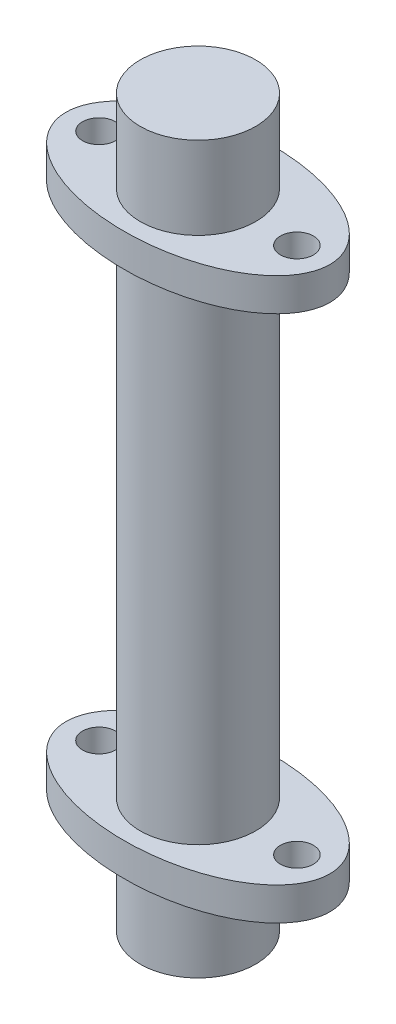
ISO-10303-21;
HEADER;
FILE_DESCRIPTION(('STEP AP214'),'2;1');
FILE_NAME('part.step','',(''),(''),'','','');
FILE_SCHEMA(('AUTOMOTIVE_DESIGN { 1 0 10303 214 1 1 1 1 }'));
ENDSEC;
DATA;
#1=APPLICATION_CONTEXT('core data for automotive mechanical design processes');
#2=APPLICATION_PROTOCOL_DEFINITION('international standard','automotive_design',2000,#1);
#3=PRODUCT_CONTEXT('',#1,'mechanical');
#4=PRODUCT('Part','Part','',(#3));
#5=PRODUCT_RELATED_PRODUCT_CATEGORY('part','',(#4));
#6=PRODUCT_DEFINITION_FORMATION('','',#4);
#7=PRODUCT_DEFINITION_CONTEXT('part definition',#1,'design');
#8=PRODUCT_DEFINITION('design','',#6,#7);
#9=PRODUCT_DEFINITION_SHAPE('','',#8);
#10=(LENGTH_UNIT() NAMED_UNIT(*) SI_UNIT(.MILLI.,.METRE.));
#11=(NAMED_UNIT(*) PLANE_ANGLE_UNIT() SI_UNIT($,.RADIAN.));
#12=(NAMED_UNIT(*) SI_UNIT($,.STERADIAN.) SOLID_ANGLE_UNIT());
#13=UNCERTAINTY_MEASURE_WITH_UNIT(LENGTH_MEASURE(1.E-05),#10,'distance_accuracy_value','');
#14=(GEOMETRIC_REPRESENTATION_CONTEXT(3) GLOBAL_UNCERTAINTY_ASSIGNED_CONTEXT((#13)) GLOBAL_UNIT_ASSIGNED_CONTEXT((#10,
#11,#12)) REPRESENTATION_CONTEXT('',''));
#15=CARTESIAN_POINT('',(0.,0.,0.));
#16=DIRECTION('',(0.,0.,1.));
#17=DIRECTION('',(1.,0.,0.));
#18=AXIS2_PLACEMENT_3D('',#15,#16,#17);
#19=CARTESIAN_POINT('',(0.,17.,0.));
#20=DIRECTION('',(0.,1.,0.));
#21=DIRECTION('',(0.,0.,1.));
#22=AXIS2_PLACEMENT_3D('',#19,#20,#21);
#23=PLANE('',#22);
#24=CARTESIAN_POINT('',(-6.,17.,0.));
#25=DIRECTION('',(0.,1.,0.));
#26=DIRECTION('',(0.,0.,-1.));
#27=AXIS2_PLACEMENT_3D('',#24,#25,#26);
#28=CIRCLE('',#27,1.);
#29=CARTESIAN_POINT('',(-6.,17.,-1.));
#30=VERTEX_POINT('',#29);
#31=EDGE_CURVE('E111',#30,#30,#28,.T.);
#32=ORIENTED_EDGE('',*,*,#31,.F.);
#33=EDGE_LOOP('',(#32));
#34=FACE_BOUND('',#33,.T.);
#35=CARTESIAN_POINT('',(0.,17.,0.));
#36=DIRECTION('',(0.,1.,0.));
#37=DIRECTION('',(1.,0.,0.));
#38=AXIS2_PLACEMENT_3D('',#35,#36,#37);
#39=ELLIPSE('',#38,8.,4.5);
#40=CARTESIAN_POINT('',(8.,17.,0.));
#41=VERTEX_POINT('',#40);
#42=EDGE_CURVE('E42',#41,#41,#39,.T.);
#43=ORIENTED_EDGE('',*,*,#42,.T.);
#44=EDGE_LOOP('',(#43));
#45=FACE_BOUND('',#44,.T.);
#46=CARTESIAN_POINT('',(6.,17.,0.));
#47=DIRECTION('',(0.,1.,0.));
#48=DIRECTION('',(0.,0.,1.));
#49=AXIS2_PLACEMENT_3D('',#46,#47,#48);
#50=CIRCLE('',#49,1.);
#51=CARTESIAN_POINT('',(6.,17.,1.));
#52=VERTEX_POINT('',#51);
#53=EDGE_CURVE('E50',#52,#52,#50,.T.);
#54=ORIENTED_EDGE('',*,*,#53,.F.);
#55=EDGE_LOOP('',(#54));
#56=FACE_BOUND('',#55,.T.);
#57=CARTESIAN_POINT('',(0.,17.,0.));
#58=DIRECTION('',(0.,1.,0.));
#59=DIRECTION('',(0.,0.,1.));
#60=AXIS2_PLACEMENT_3D('',#57,#58,#59);
#61=CIRCLE('',#60,3.5);
#62=CARTESIAN_POINT('',(0.,17.,3.5));
#63=VERTEX_POINT('',#62);
#64=EDGE_CURVE('E104',#63,#63,#61,.T.);
#65=ORIENTED_EDGE('',*,*,#64,.F.);
#66=EDGE_LOOP('',(#65));
#67=FACE_BOUND('',#66,.T.);
#68=ADVANCED_FACE('F31',(#34,#45,#56,#67),#23,.T.);
#69=CARTESIAN_POINT('',(0.,15.,0.));
#70=DIRECTION('',(0.,-1.,0.));
#71=DIRECTION('',(0.,0.,-1.));
#72=AXIS2_PLACEMENT_3D('',#69,#70,#71);
#73=CYLINDRICAL_SURFACE('',#72,3.5);
#74=CARTESIAN_POINT('',(0.,15.,0.));
#75=DIRECTION('',(0.,1.,0.));
#76=DIRECTION('',(0.,0.,1.));
#77=AXIS2_PLACEMENT_3D('',#74,#75,#76);
#78=CIRCLE('',#77,3.5);
#79=CARTESIAN_POINT('',(0.,15.,3.5));
#80=VERTEX_POINT('',#79);
#81=EDGE_CURVE('E38',#80,#80,#78,.T.);
#82=ORIENTED_EDGE('',*,*,#81,.F.);
#83=EDGE_LOOP('',(#82));
#84=FACE_BOUND('',#83,.T.);
#85=CARTESIAN_POINT('',(0.,-15.,0.));
#86=DIRECTION('',(0.,-1.,0.));
#87=DIRECTION('',(0.,0.,-1.));
#88=AXIS2_PLACEMENT_3D('',#85,#86,#87);
#89=CIRCLE('',#88,3.5);
#90=CARTESIAN_POINT('',(0.,-15.,-3.5));
#91=VERTEX_POINT('',#90);
#92=EDGE_CURVE('E95',#91,#91,#89,.T.);
#93=ORIENTED_EDGE('',*,*,#92,.F.);
#94=EDGE_LOOP('',(#93));
#95=FACE_BOUND('',#94,.T.);
#96=ADVANCED_FACE('F33',(#84,#95),#73,.T.);
#97=CARTESIAN_POINT('',(0.,15.,0.));
#98=DIRECTION('',(0.,1.,0.));
#99=DIRECTION('',(0.,0.,1.));
#100=AXIS2_PLACEMENT_3D('',#97,#98,#99);
#101=PLANE('',#100);
#102=CARTESIAN_POINT('',(-6.,15.,0.));
#103=DIRECTION('',(0.,1.,0.));
#104=DIRECTION('',(0.,0.,-1.));
#105=AXIS2_PLACEMENT_3D('',#102,#103,#104);
#106=CIRCLE('',#105,1.);
#107=CARTESIAN_POINT('',(-6.,15.,-1.));
#108=VERTEX_POINT('',#107);
#109=EDGE_CURVE('E108',#108,#108,#106,.T.);
#110=ORIENTED_EDGE('',*,*,#109,.T.);
#111=EDGE_LOOP('',(#110));
#112=FACE_BOUND('',#111,.T.);
#113=CARTESIAN_POINT('',(0.,15.,0.));
#114=DIRECTION('',(0.,1.,0.));
#115=DIRECTION('',(1.,0.,0.));
#116=AXIS2_PLACEMENT_3D('',#113,#114,#115);
#117=ELLIPSE('',#116,8.,4.5);
#118=CARTESIAN_POINT('',(8.,15.,0.));
#119=VERTEX_POINT('',#118);
#120=EDGE_CURVE('E46',#119,#119,#117,.T.);
#121=ORIENTED_EDGE('',*,*,#120,.F.);
#122=EDGE_LOOP('',(#121));
#123=FACE_BOUND('',#122,.T.);
#124=CARTESIAN_POINT('',(6.,15.,0.));
#125=DIRECTION('',(0.,1.,0.));
#126=DIRECTION('',(0.,0.,1.));
#127=AXIS2_PLACEMENT_3D('',#124,#125,#126);
#128=CIRCLE('',#127,1.);
#129=CARTESIAN_POINT('',(6.,15.,1.));
#130=VERTEX_POINT('',#129);
#131=EDGE_CURVE('E53',#130,#130,#128,.T.);
#132=ORIENTED_EDGE('',*,*,#131,.T.);
#133=EDGE_LOOP('',(#132));
#134=FACE_BOUND('',#133,.T.);
#135=ORIENTED_EDGE('',*,*,#81,.T.);
#136=EDGE_LOOP('',(#135));
#137=FACE_BOUND('',#136,.T.);
#138=ADVANCED_FACE('F59',(#112,#123,#134,#137),#101,.F.);
#139=DIRECTION('',(0.,-1.,0.));
#140=VECTOR('',#139,1.);
#141=SURFACE_OF_LINEAR_EXTRUSION('',#39,#140);
#142=ORIENTED_EDGE('',*,*,#42,.F.);
#143=EDGE_LOOP('',(#142));
#144=FACE_BOUND('',#143,.T.);
#145=ORIENTED_EDGE('',*,*,#120,.T.);
#146=EDGE_LOOP('',(#145));
#147=FACE_BOUND('',#146,.T.);
#148=ADVANCED_FACE('F55',(#144,#147),#141,.F.);
#149=CARTESIAN_POINT('',(6.,17.,0.));
#150=DIRECTION('',(0.,-1.,0.));
#151=DIRECTION('',(0.,0.,-1.));
#152=AXIS2_PLACEMENT_3D('',#149,#150,#151);
#153=CYLINDRICAL_SURFACE('',#152,1.);
#154=ORIENTED_EDGE('',*,*,#53,.T.);
#155=EDGE_LOOP('',(#154));
#156=FACE_BOUND('',#155,.T.);
#157=ORIENTED_EDGE('',*,*,#131,.F.);
#158=EDGE_LOOP('',(#157));
#159=FACE_BOUND('',#158,.T.);
#160=ADVANCED_FACE('F58',(#156,#159),#153,.F.);
#161=CARTESIAN_POINT('',(-6.,17.,0.));
#162=DIRECTION('',(0.,-1.,0.));
#163=DIRECTION('',(0.,0.,-1.));
#164=AXIS2_PLACEMENT_3D('',#161,#162,#163);
#165=CYLINDRICAL_SURFACE('',#164,1.);
#166=ORIENTED_EDGE('',*,*,#31,.T.);
#167=EDGE_LOOP('',(#166));
#168=FACE_BOUND('',#167,.T.);
#169=ORIENTED_EDGE('',*,*,#109,.F.);
#170=EDGE_LOOP('',(#169));
#171=FACE_BOUND('',#170,.T.);
#172=ADVANCED_FACE('F69',(#168,#171),#165,.F.);
#173=CARTESIAN_POINT('',(0.,22.,0.));
#174=DIRECTION('',(0.,-1.,0.));
#175=DIRECTION('',(0.,0.,-1.));
#176=AXIS2_PLACEMENT_3D('',#173,#174,#175);
#177=CYLINDRICAL_SURFACE('',#176,3.5);
#178=CARTESIAN_POINT('',(0.,22.,0.));
#179=DIRECTION('',(0.,1.,0.));
#180=DIRECTION('',(0.,0.,1.));
#181=AXIS2_PLACEMENT_3D('',#178,#179,#180);
#182=CIRCLE('',#181,3.5);
#183=CARTESIAN_POINT('',(0.,22.,3.5));
#184=VERTEX_POINT('',#183);
#185=EDGE_CURVE('E105',#184,#184,#182,.T.);
#186=ORIENTED_EDGE('',*,*,#185,.F.);
#187=EDGE_LOOP('',(#186));
#188=FACE_BOUND('',#187,.T.);
#189=ORIENTED_EDGE('',*,*,#64,.T.);
#190=EDGE_LOOP('',(#189));
#191=FACE_BOUND('',#190,.T.);
#192=ADVANCED_FACE('F73',(#188,#191),#177,.T.);
#193=CARTESIAN_POINT('',(0.,22.,0.));
#194=DIRECTION('',(0.,1.,0.));
#195=DIRECTION('',(0.,0.,1.));
#196=AXIS2_PLACEMENT_3D('',#193,#194,#195);
#197=PLANE('',#196);
#198=ORIENTED_EDGE('',*,*,#185,.T.);
#199=EDGE_LOOP('',(#198));
#200=FACE_BOUND('',#199,.T.);
#201=ADVANCED_FACE('F77',(#200),#197,.T.);
#202=CARTESIAN_POINT('',(0.,-15.,0.));
#203=DIRECTION('',(0.,-1.,0.));
#204=DIRECTION('',(0.,0.,1.));
#205=AXIS2_PLACEMENT_3D('',#202,#203,#204);
#206=PLANE('',#205);
#207=CARTESIAN_POINT('',(0.,-15.,0.));
#208=DIRECTION('',(0.,1.,0.));
#209=DIRECTION('',(1.,0.,0.));
#210=AXIS2_PLACEMENT_3D('',#207,#208,#209);
#211=ELLIPSE('',#210,8.,4.5);
#212=CARTESIAN_POINT('',(8.,-15.,0.));
#213=VERTEX_POINT('',#212);
#214=EDGE_CURVE('E96',#213,#213,#211,.T.);
#215=ORIENTED_EDGE('',*,*,#214,.T.);
#216=EDGE_LOOP('',(#215));
#217=FACE_BOUND('',#216,.T.);
#218=CARTESIAN_POINT('',(6.,-15.,0.));
#219=DIRECTION('',(0.,1.,0.));
#220=DIRECTION('',(0.,0.,1.));
#221=AXIS2_PLACEMENT_3D('',#218,#219,#220);
#222=CIRCLE('',#221,1.);
#223=CARTESIAN_POINT('',(6.,-15.,1.));
#224=VERTEX_POINT('',#223);
#225=EDGE_CURVE('E97',#224,#224,#222,.T.);
#226=ORIENTED_EDGE('',*,*,#225,.F.);
#227=EDGE_LOOP('',(#226));
#228=FACE_BOUND('',#227,.T.);
#229=CARTESIAN_POINT('',(-6.,-15.,0.));
#230=DIRECTION('',(0.,1.,0.));
#231=DIRECTION('',(0.,0.,-1.));
#232=AXIS2_PLACEMENT_3D('',#229,#230,#231);
#233=CIRCLE('',#232,1.);
#234=CARTESIAN_POINT('',(-6.,-15.,-1.));
#235=VERTEX_POINT('',#234);
#236=EDGE_CURVE('E255',#235,#235,#233,.T.);
#237=ORIENTED_EDGE('',*,*,#236,.F.);
#238=EDGE_LOOP('',(#237));
#239=FACE_BOUND('',#238,.T.);
#240=ORIENTED_EDGE('',*,*,#92,.T.);
#241=EDGE_LOOP('',(#240));
#242=FACE_BOUND('',#241,.T.);
#243=ADVANCED_FACE('F81',(#217,#228,#239,#242),#206,.F.);
#244=CARTESIAN_POINT('',(0.,-17.,0.));
#245=DIRECTION('',(0.,1.,0.));
#246=DIRECTION('',(1.,0.,0.));
#247=AXIS2_PLACEMENT_3D('',#244,#245,#246);
#248=ELLIPSE('',#247,8.,4.5);
#249=DIRECTION('',(0.,1.,0.));
#250=VECTOR('',#249,1.);
#251=SURFACE_OF_LINEAR_EXTRUSION('',#248,#250);
#252=CARTESIAN_POINT('',(8.,-17.,0.));
#253=VERTEX_POINT('',#252);
#254=EDGE_CURVE('E90',#253,#253,#248,.T.);
#255=ORIENTED_EDGE('',*,*,#254,.T.);
#256=EDGE_LOOP('',(#255));
#257=FACE_BOUND('',#256,.T.);
#258=ORIENTED_EDGE('',*,*,#214,.F.);
#259=EDGE_LOOP('',(#258));
#260=FACE_BOUND('',#259,.T.);
#261=ADVANCED_FACE('F83',(#257,#260),#251,.T.);
#262=CARTESIAN_POINT('',(0.,-17.,0.));
#263=DIRECTION('',(0.,-1.,0.));
#264=DIRECTION('',(0.,0.,1.));
#265=AXIS2_PLACEMENT_3D('',#262,#263,#264);
#266=PLANE('',#265);
#267=CARTESIAN_POINT('',(0.,-17.,0.));
#268=DIRECTION('',(0.,-1.,0.));
#269=DIRECTION('',(0.,0.,-1.));
#270=AXIS2_PLACEMENT_3D('',#267,#268,#269);
#271=CIRCLE('',#270,3.5);
#272=CARTESIAN_POINT('',(0.,-17.,-3.5));
#273=VERTEX_POINT('',#272);
#274=EDGE_CURVE('E10',#273,#273,#271,.T.);
#275=ORIENTED_EDGE('',*,*,#274,.F.);
#276=EDGE_LOOP('',(#275));
#277=FACE_BOUND('',#276,.T.);
#278=CARTESIAN_POINT('',(-6.,-17.,0.));
#279=DIRECTION('',(0.,1.,0.));
#280=DIRECTION('',(0.,0.,-1.));
#281=AXIS2_PLACEMENT_3D('',#278,#279,#280);
#282=CIRCLE('',#281,1.);
#283=CARTESIAN_POINT('',(-6.,-17.,-1.));
#284=VERTEX_POINT('',#283);
#285=EDGE_CURVE('E258',#284,#284,#282,.T.);
#286=ORIENTED_EDGE('',*,*,#285,.T.);
#287=EDGE_LOOP('',(#286));
#288=FACE_BOUND('',#287,.T.);
#289=CARTESIAN_POINT('',(6.,-17.,0.));
#290=DIRECTION('',(0.,1.,0.));
#291=DIRECTION('',(0.,0.,1.));
#292=AXIS2_PLACEMENT_3D('',#289,#290,#291);
#293=CIRCLE('',#292,1.);
#294=CARTESIAN_POINT('',(6.,-17.,1.));
#295=VERTEX_POINT('',#294);
#296=EDGE_CURVE('E101',#295,#295,#293,.T.);
#297=ORIENTED_EDGE('',*,*,#296,.T.);
#298=EDGE_LOOP('',(#297));
#299=FACE_BOUND('',#298,.T.);
#300=ORIENTED_EDGE('',*,*,#254,.F.);
#301=EDGE_LOOP('',(#300));
#302=FACE_BOUND('',#301,.T.);
#303=ADVANCED_FACE('F87',(#277,#288,#299,#302),#266,.T.);
#304=CARTESIAN_POINT('',(6.,-17.,0.));
#305=DIRECTION('',(0.,1.,0.));
#306=DIRECTION('',(0.,0.,1.));
#307=AXIS2_PLACEMENT_3D('',#304,#305,#306);
#308=CYLINDRICAL_SURFACE('',#307,1.);
#309=ORIENTED_EDGE('',*,*,#296,.F.);
#310=EDGE_LOOP('',(#309));
#311=FACE_BOUND('',#310,.T.);
#312=ORIENTED_EDGE('',*,*,#225,.T.);
#313=EDGE_LOOP('',(#312));
#314=FACE_BOUND('',#313,.T.);
#315=ADVANCED_FACE('F183',(#311,#314),#308,.F.);
#316=CARTESIAN_POINT('',(-6.,-17.,0.));
#317=DIRECTION('',(0.,1.,0.));
#318=DIRECTION('',(0.,0.,1.));
#319=AXIS2_PLACEMENT_3D('',#316,#317,#318);
#320=CYLINDRICAL_SURFACE('',#319,1.);
#321=ORIENTED_EDGE('',*,*,#285,.F.);
#322=EDGE_LOOP('',(#321));
#323=FACE_BOUND('',#322,.T.);
#324=ORIENTED_EDGE('',*,*,#236,.T.);
#325=EDGE_LOOP('',(#324));
#326=FACE_BOUND('',#325,.T.);
#327=ADVANCED_FACE('F190',(#323,#326),#320,.F.);
#328=CARTESIAN_POINT('',(0.,-22.,0.));
#329=DIRECTION('',(0.,1.,0.));
#330=DIRECTION('',(0.,0.,1.));
#331=AXIS2_PLACEMENT_3D('',#328,#329,#330);
#332=CYLINDRICAL_SURFACE('',#331,3.5);
#333=CARTESIAN_POINT('',(0.,-22.,0.));
#334=DIRECTION('',(0.,1.,0.));
#335=DIRECTION('',(0.,0.,1.));
#336=AXIS2_PLACEMENT_3D('',#333,#334,#335);
#337=CIRCLE('',#336,3.5);
#338=CARTESIAN_POINT('',(0.,-22.,3.5));
#339=VERTEX_POINT('',#338);
#340=EDGE_CURVE('E254',#339,#339,#337,.T.);
#341=ORIENTED_EDGE('',*,*,#340,.T.);
#342=EDGE_LOOP('',(#341));
#343=FACE_BOUND('',#342,.T.);
#344=ORIENTED_EDGE('',*,*,#274,.T.);
#345=EDGE_LOOP('',(#344));
#346=FACE_BOUND('',#345,.T.);
#347=ADVANCED_FACE('F198',(#343,#346),#332,.T.);
#348=CARTESIAN_POINT('',(0.,-22.,0.));
#349=DIRECTION('',(0.,-1.,0.));
#350=DIRECTION('',(0.,0.,1.));
#351=AXIS2_PLACEMENT_3D('',#348,#349,#350);
#352=PLANE('',#351);
#353=ORIENTED_EDGE('',*,*,#340,.F.);
#354=EDGE_LOOP('',(#353));
#355=FACE_BOUND('',#354,.T.);
#356=ADVANCED_FACE('F206',(#355),#352,.T.);
#357=CLOSED_SHELL('',(#68,#96,#138,#148,#160,#172,#192,#201,#243,#261,#303,#315,#327,#347,#356));
#358=MANIFOLD_SOLID_BREP('B2',#357);
#359=ADVANCED_BREP_SHAPE_REPRESENTATION('',(#18,#358),#14);
#360=SHAPE_DEFINITION_REPRESENTATION(#9,#359);
ENDSEC;
END-ISO-10303-21;
